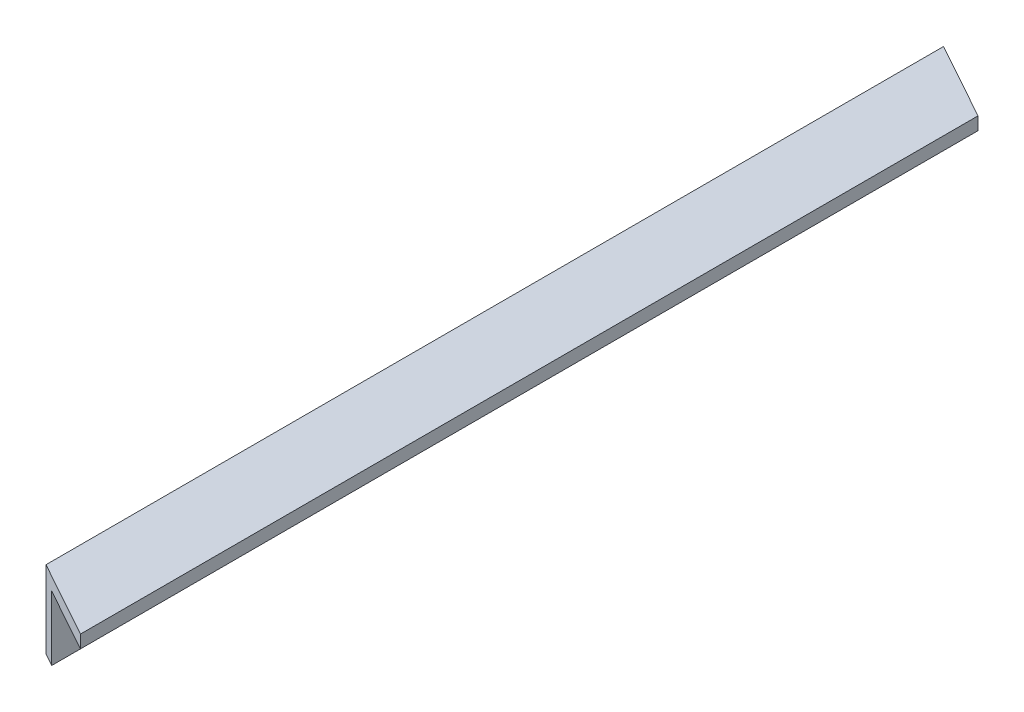
ISO-10303-21;
HEADER;
FILE_DESCRIPTION(('STEP AP214'),'2;1');
FILE_NAME('part.step','',(''),(''),'','','');
FILE_SCHEMA(('AUTOMOTIVE_DESIGN { 1 0 10303 214 1 1 1 1 }'));
ENDSEC;
DATA;
#1=APPLICATION_CONTEXT('core data for automotive mechanical design processes');
#2=APPLICATION_PROTOCOL_DEFINITION('international standard','automotive_design',2000,#1);
#3=PRODUCT_CONTEXT('',#1,'mechanical');
#4=PRODUCT('Part','Part','',(#3));
#5=PRODUCT_RELATED_PRODUCT_CATEGORY('part','',(#4));
#6=PRODUCT_DEFINITION_FORMATION('','',#4);
#7=PRODUCT_DEFINITION_CONTEXT('part definition',#1,'design');
#8=PRODUCT_DEFINITION('design','',#6,#7);
#9=PRODUCT_DEFINITION_SHAPE('','',#8);
#10=(LENGTH_UNIT() NAMED_UNIT(*) SI_UNIT(.MILLI.,.METRE.));
#11=(NAMED_UNIT(*) PLANE_ANGLE_UNIT() SI_UNIT($,.RADIAN.));
#12=(NAMED_UNIT(*) SI_UNIT($,.STERADIAN.) SOLID_ANGLE_UNIT());
#13=UNCERTAINTY_MEASURE_WITH_UNIT(LENGTH_MEASURE(1.E-05),#10,'distance_accuracy_value','');
#14=(GEOMETRIC_REPRESENTATION_CONTEXT(3) GLOBAL_UNCERTAINTY_ASSIGNED_CONTEXT((#13)) GLOBAL_UNIT_ASSIGNED_CONTEXT((#10,
#11,#12)) REPRESENTATION_CONTEXT('',''));
#15=CARTESIAN_POINT('',(0.,0.,0.));
#16=DIRECTION('',(0.,0.,1.));
#17=DIRECTION('',(1.,0.,0.));
#18=AXIS2_PLACEMENT_3D('',#15,#16,#17);
#19=CARTESIAN_POINT('',(38.1,0.,463.55));
#20=DIRECTION('',(0.,-1.,0.));
#21=DIRECTION('',(1.,0.,0.));
#22=AXIS2_PLACEMENT_3D('',#19,#20,#21);
#23=PLANE('',#22);
#24=DIRECTION('',(0.,0.,-1.));
#25=VECTOR('',#24,1.);
#26=CARTESIAN_POINT('',(38.1,0.,463.55));
#27=LINE('',#26,#25);
#28=CARTESIAN_POINT('',(38.1,0.,463.55));
#29=VERTEX_POINT('',#28);
#30=CARTESIAN_POINT('',(38.1,0.,21.1191748603508));
#31=VERTEX_POINT('',#30);
#32=EDGE_CURVE('E98',#29,#31,#27,.T.);
#33=ORIENTED_EDGE('',*,*,#32,.T.);
#34=DIRECTION('',(0.874619707139393,0.,0.484809620246342));
#35=VECTOR('',#34,1.);
#36=CARTESIAN_POINT('',(0.,0.,0.));
#37=LINE('',#36,#35);
#38=CARTESIAN_POINT('',(0.,0.,0.));
#39=VERTEX_POINT('',#38);
#40=EDGE_CURVE('E83',#39,#31,#37,.T.);
#41=ORIENTED_EDGE('',*,*,#40,.F.);
#42=DIRECTION('',(0.,0.,-1.));
#43=VECTOR('',#42,1.);
#44=CARTESIAN_POINT('',(0.,0.,463.55));
#45=LINE('',#44,#43);
#46=CARTESIAN_POINT('',(0.,0.,442.430825139649));
#47=VERTEX_POINT('',#46);
#48=EDGE_CURVE('E11',#47,#39,#45,.T.);
#49=ORIENTED_EDGE('',*,*,#48,.F.);
#50=DIRECTION('',(-0.874619707139396,0.,-0.484809620246337));
#51=VECTOR('',#50,1.);
#52=CARTESIAN_POINT('',(38.1,0.,463.55));
#53=LINE('',#52,#51);
#54=EDGE_CURVE('E106',#29,#47,#53,.T.);
#55=ORIENTED_EDGE('',*,*,#54,.F.);
#56=EDGE_LOOP('',(#33,#41,#49,#55));
#57=FACE_BOUND('',#56,.T.);
#58=ADVANCED_FACE('F33',(#57),#23,.F.);
#59=CARTESIAN_POINT('',(0.,0.,463.55));
#60=DIRECTION('',(1.,0.,0.));
#61=DIRECTION('',(0.,0.,-1.));
#62=AXIS2_PLACEMENT_3D('',#59,#60,#61);
#63=PLANE('',#62);
#64=DIRECTION('',(0.,0.,-1.));
#65=VECTOR('',#64,1.);
#66=CARTESIAN_POINT('',(0.,-38.1,463.55));
#67=LINE('',#66,#65);
#68=CARTESIAN_POINT('',(0.,-38.1,442.430825139649));
#69=VERTEX_POINT('',#68);
#70=CARTESIAN_POINT('',(0.,-38.1,0.));
#71=VERTEX_POINT('',#70);
#72=EDGE_CURVE('E41',#69,#71,#67,.T.);
#73=ORIENTED_EDGE('',*,*,#72,.F.);
#74=DIRECTION('',(0.,1.,0.));
#75=VECTOR('',#74,1.);
#76=CARTESIAN_POINT('',(0.,-38.1,442.430825139649));
#77=LINE('',#76,#75);
#78=EDGE_CURVE('E99',#69,#47,#77,.T.);
#79=ORIENTED_EDGE('',*,*,#78,.T.);
#80=ORIENTED_EDGE('',*,*,#48,.T.);
#81=DIRECTION('',(0.,-1.,0.));
#82=VECTOR('',#81,1.);
#83=CARTESIAN_POINT('',(0.,0.,0.));
#84=LINE('',#83,#82);
#85=EDGE_CURVE('E80',#39,#71,#84,.T.);
#86=ORIENTED_EDGE('',*,*,#85,.T.);
#87=EDGE_LOOP('',(#73,#79,#80,#86));
#88=FACE_BOUND('',#87,.T.);
#89=ADVANCED_FACE('F102',(#88),#63,.F.);
#90=CARTESIAN_POINT('',(0.,-38.1,463.55));
#91=DIRECTION('',(0.,1.,0.));
#92=DIRECTION('',(0.,0.,1.));
#93=AXIS2_PLACEMENT_3D('',#90,#91,#92);
#94=PLANE('',#93);
#95=ORIENTED_EDGE('',*,*,#72,.T.);
#96=DIRECTION('',(0.874619707139393,0.,0.484809620246342));
#97=VECTOR('',#96,1.);
#98=CARTESIAN_POINT('',(0.,-38.1,0.));
#99=LINE('',#98,#97);
#100=CARTESIAN_POINT('',(6.35,-38.1,3.51986247672513));
#101=VERTEX_POINT('',#100);
#102=EDGE_CURVE('E86',#71,#101,#99,.T.);
#103=ORIENTED_EDGE('',*,*,#102,.T.);
#104=DIRECTION('',(0.,0.,-1.));
#105=VECTOR('',#104,1.);
#106=CARTESIAN_POINT('',(6.35,-38.1,463.55));
#107=LINE('',#106,#105);
#108=CARTESIAN_POINT('',(6.35,-38.1,445.950687616375));
#109=VERTEX_POINT('',#108);
#110=EDGE_CURVE('E128',#109,#101,#107,.T.);
#111=ORIENTED_EDGE('',*,*,#110,.F.);
#112=DIRECTION('',(-0.874619707139396,0.,-0.484809620246337));
#113=VECTOR('',#112,1.);
#114=CARTESIAN_POINT('',(38.1,-38.1,463.55));
#115=LINE('',#114,#113);
#116=EDGE_CURVE('E104',#109,#69,#115,.T.);
#117=ORIENTED_EDGE('',*,*,#116,.T.);
#118=EDGE_LOOP('',(#95,#103,#111,#117));
#119=FACE_BOUND('',#118,.T.);
#120=ADVANCED_FACE('F131',(#119),#94,.F.);
#121=CARTESIAN_POINT('',(6.35,-38.1,463.55));
#122=DIRECTION('',(-1.,0.,0.));
#123=DIRECTION('',(0.,0.,1.));
#124=AXIS2_PLACEMENT_3D('',#121,#122,#123);
#125=PLANE('',#124);
#126=ORIENTED_EDGE('',*,*,#110,.T.);
#127=DIRECTION('',(0.,1.,0.));
#128=VECTOR('',#127,1.);
#129=CARTESIAN_POINT('',(6.35,-38.1,3.51986247672514));
#130=LINE('',#129,#128);
#131=CARTESIAN_POINT('',(6.34999999999999,-6.35,3.51986247672509));
#132=VERTEX_POINT('',#131);
#133=EDGE_CURVE('E113',#101,#132,#130,.T.);
#134=ORIENTED_EDGE('',*,*,#133,.T.);
#135=DIRECTION('',(0.,0.,-1.));
#136=VECTOR('',#135,1.);
#137=CARTESIAN_POINT('',(6.35,-6.35,463.55));
#138=LINE('',#137,#136);
#139=CARTESIAN_POINT('',(6.35,-6.35,445.950687616375));
#140=VERTEX_POINT('',#139);
#141=EDGE_CURVE('E125',#140,#132,#138,.T.);
#142=ORIENTED_EDGE('',*,*,#141,.F.);
#143=DIRECTION('',(0.,-1.,0.));
#144=VECTOR('',#143,1.);
#145=CARTESIAN_POINT('',(6.35,-38.1,445.950687616375));
#146=LINE('',#145,#144);
#147=EDGE_CURVE('E91',#140,#109,#146,.T.);
#148=ORIENTED_EDGE('',*,*,#147,.T.);
#149=EDGE_LOOP('',(#126,#134,#142,#148));
#150=FACE_BOUND('',#149,.T.);
#151=ADVANCED_FACE('F136',(#150),#125,.F.);
#152=CARTESIAN_POINT('',(6.35,-6.35,463.55));
#153=DIRECTION('',(0.,1.,0.));
#154=DIRECTION('',(0.,0.,1.));
#155=AXIS2_PLACEMENT_3D('',#152,#153,#154);
#156=PLANE('',#155);
#157=ORIENTED_EDGE('',*,*,#141,.T.);
#158=DIRECTION('',(0.874619707139393,0.,0.484809620246342));
#159=VECTOR('',#158,1.);
#160=CARTESIAN_POINT('',(201.413841150597,-6.35,111.645515237648));
#161=LINE('',#160,#159);
#162=CARTESIAN_POINT('',(38.1,-6.35000000000002,21.1191748603508));
#163=VERTEX_POINT('',#162);
#164=EDGE_CURVE('E110',#132,#163,#161,.T.);
#165=ORIENTED_EDGE('',*,*,#164,.T.);
#166=DIRECTION('',(0.,0.,-1.));
#167=VECTOR('',#166,1.);
#168=CARTESIAN_POINT('',(38.1,-6.35,463.55));
#169=LINE('',#168,#167);
#170=CARTESIAN_POINT('',(38.1,-6.35,463.55));
#171=VERTEX_POINT('',#170);
#172=EDGE_CURVE('E122',#171,#163,#169,.T.);
#173=ORIENTED_EDGE('',*,*,#172,.F.);
#174=DIRECTION('',(-0.874619707139396,0.,-0.484809620246337));
#175=VECTOR('',#174,1.);
#176=CARTESIAN_POINT('',(13.8125316802979,-6.35,450.087236473517));
#177=LINE('',#176,#175);
#178=EDGE_CURVE('E47',#171,#140,#177,.T.);
#179=ORIENTED_EDGE('',*,*,#178,.T.);
#180=EDGE_LOOP('',(#157,#165,#173,#179));
#181=FACE_BOUND('',#180,.T.);
#182=ADVANCED_FACE('F138',(#181),#156,.F.);
#183=CARTESIAN_POINT('',(38.1,-6.35,463.55));
#184=DIRECTION('',(-1.,0.,0.));
#185=DIRECTION('',(0.,0.,1.));
#186=AXIS2_PLACEMENT_3D('',#183,#184,#185);
#187=PLANE('',#186);
#188=ORIENTED_EDGE('',*,*,#172,.T.);
#189=DIRECTION('',(0.,1.,0.));
#190=VECTOR('',#189,1.);
#191=CARTESIAN_POINT('',(38.1,-38.1,21.1191748603508));
#192=LINE('',#191,#190);
#193=EDGE_CURVE('E114',#163,#31,#192,.T.);
#194=ORIENTED_EDGE('',*,*,#193,.T.);
#195=ORIENTED_EDGE('',*,*,#32,.F.);
#196=DIRECTION('',(0.,1.,0.));
#197=VECTOR('',#196,1.);
#198=CARTESIAN_POINT('',(38.1,-6.35,463.55));
#199=LINE('',#198,#197);
#200=EDGE_CURVE('E90',#171,#29,#199,.T.);
#201=ORIENTED_EDGE('',*,*,#200,.F.);
#202=EDGE_LOOP('',(#188,#194,#195,#201));
#203=FACE_BOUND('',#202,.T.);
#204=ADVANCED_FACE('F141',(#203),#187,.F.);
#205=CARTESIAN_POINT('',(0.,-38.1,0.));
#206=DIRECTION('',(-0.484809620246342,0.,0.874619707139393));
#207=DIRECTION('',(0.874619707139393,0.,0.484809620246342));
#208=AXIS2_PLACEMENT_3D('',#205,#206,#207);
#209=PLANE('',#208);
#210=ORIENTED_EDGE('',*,*,#102,.F.);
#211=ORIENTED_EDGE('',*,*,#85,.F.);
#212=ORIENTED_EDGE('',*,*,#40,.T.);
#213=ORIENTED_EDGE('',*,*,#193,.F.);
#214=ORIENTED_EDGE('',*,*,#164,.F.);
#215=ORIENTED_EDGE('',*,*,#133,.F.);
#216=EDGE_LOOP('',(#210,#211,#212,#213,#214,#215));
#217=FACE_BOUND('',#216,.T.);
#218=ADVANCED_FACE('F82',(#217),#209,.F.);
#219=CARTESIAN_POINT('',(38.1,-38.1,463.55));
#220=DIRECTION('',(0.484809620246337,0.,-0.874619707139396));
#221=DIRECTION('',(-0.874619707139396,0.,-0.484809620246337));
#222=AXIS2_PLACEMENT_3D('',#219,#220,#221);
#223=PLANE('',#222);
#224=ORIENTED_EDGE('',*,*,#178,.F.);
#225=ORIENTED_EDGE('',*,*,#200,.T.);
#226=ORIENTED_EDGE('',*,*,#54,.T.);
#227=ORIENTED_EDGE('',*,*,#78,.F.);
#228=ORIENTED_EDGE('',*,*,#116,.F.);
#229=ORIENTED_EDGE('',*,*,#147,.F.);
#230=EDGE_LOOP('',(#224,#225,#226,#227,#228,#229));
#231=FACE_BOUND('',#230,.T.);
#232=ADVANCED_FACE('F133',(#231),#223,.F.);
#233=CLOSED_SHELL('',(#58,#89,#120,#151,#182,#204,#218,#232));
#234=MANIFOLD_SOLID_BREP('B2',#233);
#235=ADVANCED_BREP_SHAPE_REPRESENTATION('',(#18,#234),#14);
#236=SHAPE_DEFINITION_REPRESENTATION(#9,#235);
ENDSEC;
END-ISO-10303-21;
